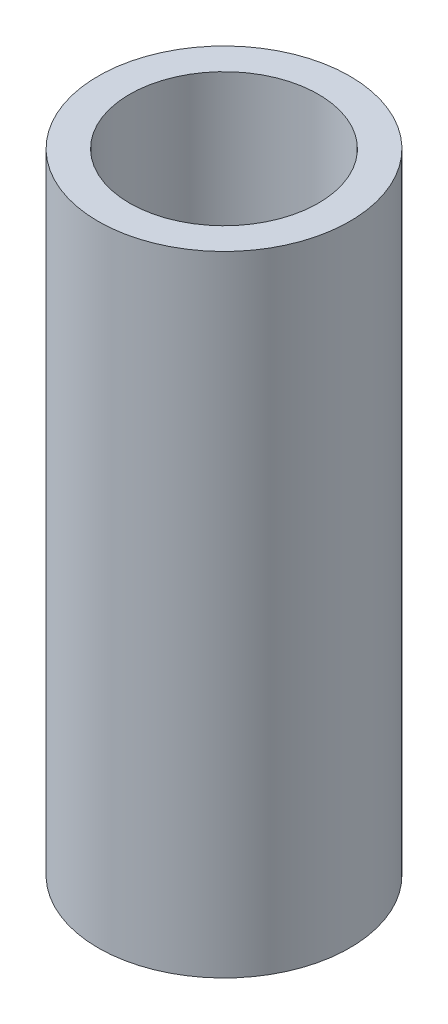
ISO-10303-21;
HEADER;
FILE_DESCRIPTION(('STEP AP214'),'2;1');
FILE_NAME('part.step','',(''),(''),'','','');
FILE_SCHEMA(('AUTOMOTIVE_DESIGN { 1 0 10303 214 1 1 1 1 }'));
ENDSEC;
DATA;
#1=APPLICATION_CONTEXT('core data for automotive mechanical design processes');
#2=APPLICATION_PROTOCOL_DEFINITION('international standard','automotive_design',2000,#1);
#3=PRODUCT_CONTEXT('',#1,'mechanical');
#4=PRODUCT('Part','Part','',(#3));
#5=PRODUCT_RELATED_PRODUCT_CATEGORY('part','',(#4));
#6=PRODUCT_DEFINITION_FORMATION('','',#4);
#7=PRODUCT_DEFINITION_CONTEXT('part definition',#1,'design');
#8=PRODUCT_DEFINITION('design','',#6,#7);
#9=PRODUCT_DEFINITION_SHAPE('','',#8);
#10=(LENGTH_UNIT() NAMED_UNIT(*) SI_UNIT(.MILLI.,.METRE.));
#11=(NAMED_UNIT(*) PLANE_ANGLE_UNIT() SI_UNIT($,.RADIAN.));
#12=(NAMED_UNIT(*) SI_UNIT($,.STERADIAN.) SOLID_ANGLE_UNIT());
#13=UNCERTAINTY_MEASURE_WITH_UNIT(LENGTH_MEASURE(1.E-05),#10,'distance_accuracy_value','');
#14=(GEOMETRIC_REPRESENTATION_CONTEXT(3) GLOBAL_UNCERTAINTY_ASSIGNED_CONTEXT((#13)) GLOBAL_UNIT_ASSIGNED_CONTEXT((#10,
#11,#12)) REPRESENTATION_CONTEXT('',''));
#15=CARTESIAN_POINT('',(0.,0.,0.));
#16=DIRECTION('',(0.,0.,1.));
#17=DIRECTION('',(1.,0.,0.));
#18=AXIS2_PLACEMENT_3D('',#15,#16,#17);
#19=CARTESIAN_POINT('',(0.,63.5,0.));
#20=DIRECTION('',(0.,-1.,0.));
#21=DIRECTION('',(0.,0.,-1.));
#22=AXIS2_PLACEMENT_3D('',#19,#20,#21);
#23=CYLINDRICAL_SURFACE('',#22,9.525);
#24=CARTESIAN_POINT('',(0.,63.5,0.));
#25=DIRECTION('',(0.,1.,0.));
#26=DIRECTION('',(0.,0.,1.));
#27=AXIS2_PLACEMENT_3D('',#24,#25,#26);
#28=CIRCLE('',#27,9.525);
#29=CARTESIAN_POINT('',(0.,63.5,9.525));
#30=VERTEX_POINT('',#29);
#31=EDGE_CURVE('E49',#30,#30,#28,.T.);
#32=ORIENTED_EDGE('',*,*,#31,.T.);
#33=EDGE_LOOP('',(#32));
#34=FACE_BOUND('',#33,.T.);
#35=CARTESIAN_POINT('',(0.,0.,0.));
#36=DIRECTION('',(0.,1.,0.));
#37=DIRECTION('',(0.,0.,1.));
#38=AXIS2_PLACEMENT_3D('',#35,#36,#37);
#39=CIRCLE('',#38,9.525);
#40=CARTESIAN_POINT('',(0.,0.,9.525));
#41=VERTEX_POINT('',#40);
#42=EDGE_CURVE('E56',#41,#41,#39,.T.);
#43=ORIENTED_EDGE('',*,*,#42,.F.);
#44=EDGE_LOOP('',(#43));
#45=FACE_BOUND('',#44,.T.);
#46=ADVANCED_FACE('F41',(#34,#45),#23,.F.);
#47=CARTESIAN_POINT('',(0.,63.5,0.));
#48=DIRECTION('',(0.,-1.,0.));
#49=DIRECTION('',(0.,0.,-1.));
#50=AXIS2_PLACEMENT_3D('',#47,#48,#49);
#51=CYLINDRICAL_SURFACE('',#50,12.7);
#52=CARTESIAN_POINT('',(0.,63.5,0.));
#53=DIRECTION('',(0.,1.,0.));
#54=DIRECTION('',(0.,0.,1.));
#55=AXIS2_PLACEMENT_3D('',#52,#53,#54);
#56=CIRCLE('',#55,12.7);
#57=CARTESIAN_POINT('',(0.,63.5,12.7));
#58=VERTEX_POINT('',#57);
#59=EDGE_CURVE('E10',#58,#58,#56,.T.);
#60=ORIENTED_EDGE('',*,*,#59,.F.);
#61=EDGE_LOOP('',(#60));
#62=FACE_BOUND('',#61,.T.);
#63=CARTESIAN_POINT('',(0.,0.,0.));
#64=DIRECTION('',(0.,1.,0.));
#65=DIRECTION('',(0.,0.,1.));
#66=AXIS2_PLACEMENT_3D('',#63,#64,#65);
#67=CIRCLE('',#66,12.7);
#68=CARTESIAN_POINT('',(0.,0.,12.7));
#69=VERTEX_POINT('',#68);
#70=EDGE_CURVE('E44',#69,#69,#67,.T.);
#71=ORIENTED_EDGE('',*,*,#70,.T.);
#72=EDGE_LOOP('',(#71));
#73=FACE_BOUND('',#72,.T.);
#74=ADVANCED_FACE('F65',(#62,#73),#51,.T.);
#75=CARTESIAN_POINT('',(0.,63.5,0.));
#76=DIRECTION('',(0.,1.,0.));
#77=DIRECTION('',(0.,0.,1.));
#78=AXIS2_PLACEMENT_3D('',#75,#76,#77);
#79=PLANE('',#78);
#80=ORIENTED_EDGE('',*,*,#31,.F.);
#81=EDGE_LOOP('',(#80));
#82=FACE_BOUND('',#81,.T.);
#83=ORIENTED_EDGE('',*,*,#59,.T.);
#84=EDGE_LOOP('',(#83));
#85=FACE_BOUND('',#84,.T.);
#86=ADVANCED_FACE('F69',(#82,#85),#79,.T.);
#87=CARTESIAN_POINT('',(0.,0.,0.));
#88=DIRECTION('',(0.,1.,0.));
#89=DIRECTION('',(0.,0.,1.));
#90=AXIS2_PLACEMENT_3D('',#87,#88,#89);
#91=PLANE('',#90);
#92=ORIENTED_EDGE('',*,*,#42,.T.);
#93=EDGE_LOOP('',(#92));
#94=FACE_BOUND('',#93,.T.);
#95=ORIENTED_EDGE('',*,*,#70,.F.);
#96=EDGE_LOOP('',(#95));
#97=FACE_BOUND('',#96,.T.);
#98=ADVANCED_FACE('F67',(#94,#97),#91,.F.);
#99=CLOSED_SHELL('',(#46,#74,#86,#98));
#100=MANIFOLD_SOLID_BREP('B2',#99);
#101=ADVANCED_BREP_SHAPE_REPRESENTATION('',(#18,#100),#14);
#102=SHAPE_DEFINITION_REPRESENTATION(#9,#101);
ENDSEC;
END-ISO-10303-21;
